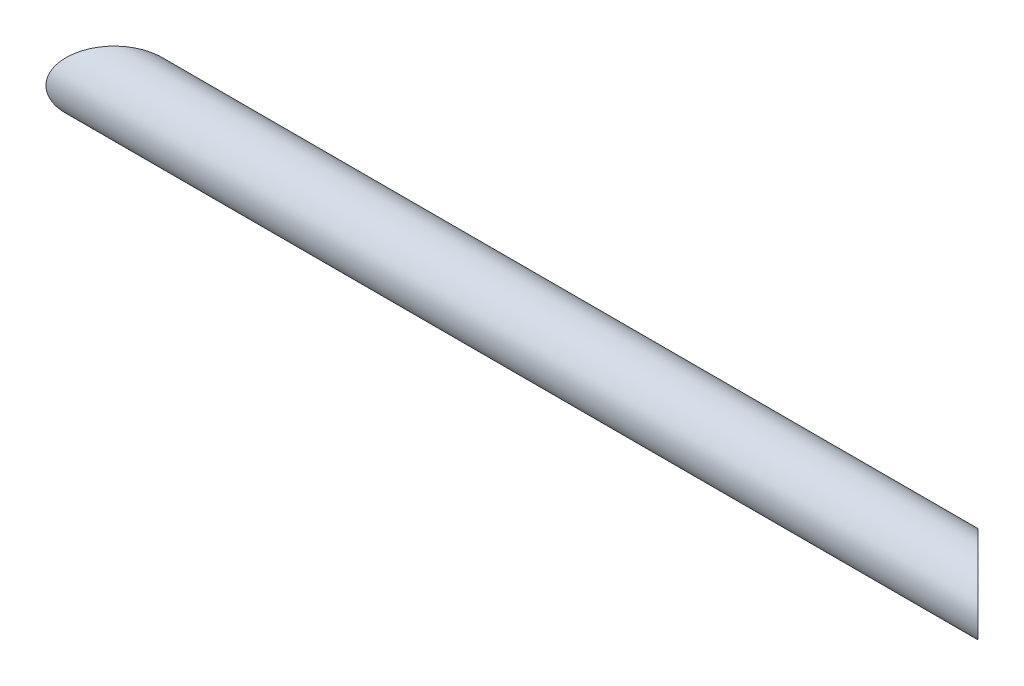
ISO-10303-21;
HEADER;
FILE_DESCRIPTION(('STEP AP214'),'2;1');
FILE_NAME('part.step','',(''),(''),'','','');
FILE_SCHEMA(('AUTOMOTIVE_DESIGN { 1 0 10303 214 1 1 1 1 }'));
ENDSEC;
DATA;
#1=APPLICATION_CONTEXT('core data for automotive mechanical design processes');
#2=APPLICATION_PROTOCOL_DEFINITION('international standard','automotive_design',2000,#1);
#3=PRODUCT_CONTEXT('',#1,'mechanical');
#4=PRODUCT('Part','Part','',(#3));
#5=PRODUCT_RELATED_PRODUCT_CATEGORY('part','',(#4));
#6=PRODUCT_DEFINITION_FORMATION('','',#4);
#7=PRODUCT_DEFINITION_CONTEXT('part definition',#1,'design');
#8=PRODUCT_DEFINITION('design','',#6,#7);
#9=PRODUCT_DEFINITION_SHAPE('','',#8);
#10=(LENGTH_UNIT() NAMED_UNIT(*) SI_UNIT(.MILLI.,.METRE.));
#11=(NAMED_UNIT(*) PLANE_ANGLE_UNIT() SI_UNIT($,.RADIAN.));
#12=(NAMED_UNIT(*) SI_UNIT($,.STERADIAN.) SOLID_ANGLE_UNIT());
#13=UNCERTAINTY_MEASURE_WITH_UNIT(LENGTH_MEASURE(1.E-05),#10,'distance_accuracy_value','');
#14=(GEOMETRIC_REPRESENTATION_CONTEXT(3) GLOBAL_UNCERTAINTY_ASSIGNED_CONTEXT((#13)) GLOBAL_UNIT_ASSIGNED_CONTEXT((#10,
#11,#12)) REPRESENTATION_CONTEXT('',''));
#15=CARTESIAN_POINT('',(0.,0.,0.));
#16=DIRECTION('',(0.,0.,1.));
#17=DIRECTION('',(1.,0.,0.));
#18=AXIS2_PLACEMENT_3D('',#15,#16,#17);
#19=CARTESIAN_POINT('',(0.,0.,0.));
#20=DIRECTION('',(1.,0.,0.));
#21=DIRECTION('',(0.,0.,-1.));
#22=AXIS2_PLACEMENT_3D('',#19,#20,#21);
#23=CYLINDRICAL_SURFACE('',#22,16.9418);
#24=CARTESIAN_POINT('',(501.65,0.,0.));
#25=DIRECTION('',(-0.707106781186548,0.,0.707106781186548));
#26=DIRECTION('',(0.707106781186548,0.,0.707106781186548));
#27=AXIS2_PLACEMENT_3D('',#24,#25,#26);
#28=ELLIPSE('',#27,23.9593233310125,16.9418);
#29=CARTESIAN_POINT('',(518.5918,0.,16.9418));
#30=VERTEX_POINT('',#29);
#31=EDGE_CURVE('E18',#30,#30,#28,.F.);
#32=ORIENTED_EDGE('',*,*,#31,.T.);
#33=EDGE_LOOP('',(#32));
#34=FACE_BOUND('',#33,.T.);
#35=CARTESIAN_POINT('',(19.05,0.,0.));
#36=DIRECTION('',(0.707106781186548,0.,0.707106781186548));
#37=DIRECTION('',(0.707106781186548,0.,-0.707106781186548));
#38=AXIS2_PLACEMENT_3D('',#35,#36,#37);
#39=ELLIPSE('',#38,23.9593233310125,16.9418);
#40=CARTESIAN_POINT('',(35.9918,0.,-16.9418));
#41=VERTEX_POINT('',#40);
#42=EDGE_CURVE('E27',#41,#41,#39,.F.);
#43=ORIENTED_EDGE('',*,*,#42,.T.);
#44=EDGE_LOOP('',(#43));
#45=FACE_BOUND('',#44,.T.);
#46=ADVANCED_FACE('F15',(#34,#45),#23,.F.);
#47=CARTESIAN_POINT('',(482.6,-65.4304,-19.05));
#48=DIRECTION('',(-0.707106781186548,0.,0.707106781186548));
#49=DIRECTION('',(0.707106781186548,0.,0.707106781186548));
#50=AXIS2_PLACEMENT_3D('',#47,#48,#49);
#51=PLANE('',#50);
#52=ORIENTED_EDGE('',*,*,#31,.F.);
#53=EDGE_LOOP('',(#52));
#54=FACE_BOUND('',#53,.T.);
#55=CARTESIAN_POINT('',(501.65,0.,0.));
#56=DIRECTION('',(-0.707106781186548,0.,0.707106781186548));
#57=DIRECTION('',(0.707106781186548,0.,0.707106781186548));
#58=AXIS2_PLACEMENT_3D('',#55,#56,#57);
#59=ELLIPSE('',#58,26.9407683632075,19.05);
#60=CARTESIAN_POINT('',(520.7,0.,19.05));
#61=VERTEX_POINT('',#60);
#62=EDGE_CURVE('E22',#61,#61,#59,.T.);
#63=ORIENTED_EDGE('',*,*,#62,.F.);
#64=EDGE_LOOP('',(#63));
#65=FACE_BOUND('',#64,.T.);
#66=ADVANCED_FACE('F36',(#54,#65),#51,.F.);
#67=CARTESIAN_POINT('',(0.,-65.4304,19.05));
#68=DIRECTION('',(0.707106781186548,0.,0.707106781186548));
#69=DIRECTION('',(0.707106781186548,0.,-0.707106781186548));
#70=AXIS2_PLACEMENT_3D('',#67,#68,#69);
#71=PLANE('',#70);
#72=ORIENTED_EDGE('',*,*,#42,.F.);
#73=EDGE_LOOP('',(#72));
#74=FACE_BOUND('',#73,.T.);
#75=CARTESIAN_POINT('',(19.05,0.,0.));
#76=DIRECTION('',(0.707106781186548,0.,0.707106781186548));
#77=DIRECTION('',(0.707106781186548,0.,-0.707106781186548));
#78=AXIS2_PLACEMENT_3D('',#75,#76,#77);
#79=ELLIPSE('',#78,26.9407683632075,19.05);
#80=CARTESIAN_POINT('',(38.1,0.,-19.05));
#81=VERTEX_POINT('',#80);
#82=EDGE_CURVE('E10',#81,#81,#79,.T.);
#83=ORIENTED_EDGE('',*,*,#82,.F.);
#84=EDGE_LOOP('',(#83));
#85=FACE_BOUND('',#84,.T.);
#86=ADVANCED_FACE('F39',(#74,#85),#71,.F.);
#87=CARTESIAN_POINT('',(0.,0.,0.));
#88=DIRECTION('',(1.,0.,0.));
#89=DIRECTION('',(0.,0.,-1.));
#90=AXIS2_PLACEMENT_3D('',#87,#88,#89);
#91=CYLINDRICAL_SURFACE('',#90,19.05);
#92=ORIENTED_EDGE('',*,*,#62,.T.);
#93=EDGE_LOOP('',(#92));
#94=FACE_BOUND('',#93,.T.);
#95=ORIENTED_EDGE('',*,*,#82,.T.);
#96=EDGE_LOOP('',(#95));
#97=FACE_BOUND('',#96,.T.);
#98=ADVANCED_FACE('F42',(#94,#97),#91,.T.);
#99=CLOSED_SHELL('',(#46,#66,#86,#98));
#100=MANIFOLD_SOLID_BREP('B1',#99);
#101=ADVANCED_BREP_SHAPE_REPRESENTATION('',(#18,#100),#14);
#102=SHAPE_DEFINITION_REPRESENTATION(#9,#101);
ENDSEC;
END-ISO-10303-21;
